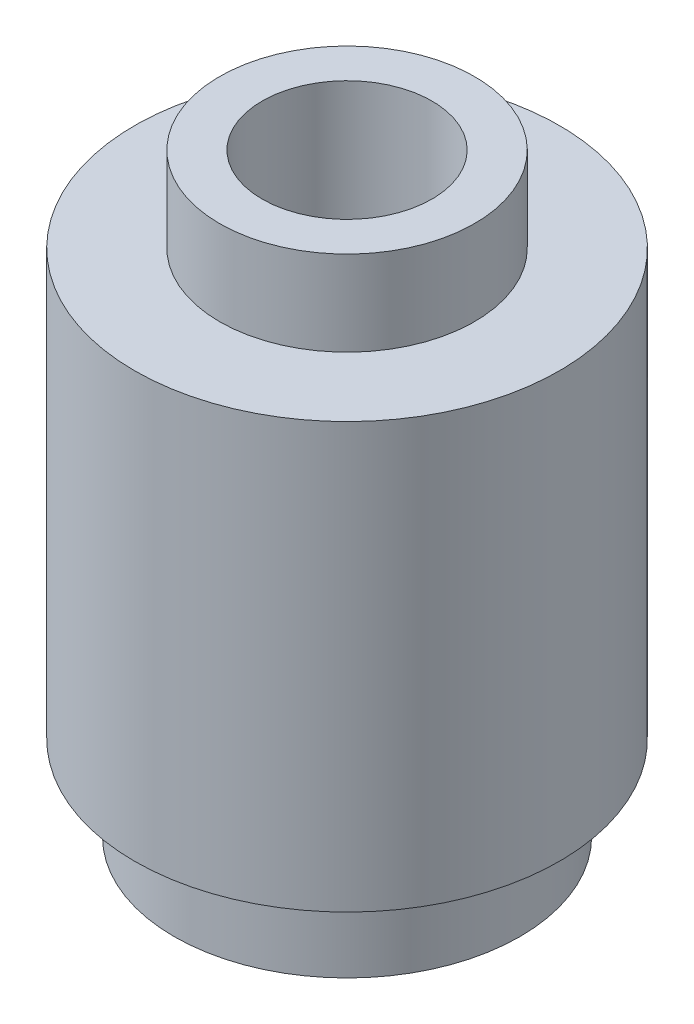
ISO-10303-21;
HEADER;
FILE_DESCRIPTION(('STEP AP214'),'2;1');
FILE_NAME('part.step','',(''),(''),'','','');
FILE_SCHEMA(('AUTOMOTIVE_DESIGN { 1 0 10303 214 1 1 1 1 }'));
ENDSEC;
DATA;
#1=APPLICATION_CONTEXT('core data for automotive mechanical design processes');
#2=APPLICATION_PROTOCOL_DEFINITION('international standard','automotive_design',2000,#1);
#3=PRODUCT_CONTEXT('',#1,'mechanical');
#4=PRODUCT('Part','Part','',(#3));
#5=PRODUCT_RELATED_PRODUCT_CATEGORY('part','',(#4));
#6=PRODUCT_DEFINITION_FORMATION('','',#4);
#7=PRODUCT_DEFINITION_CONTEXT('part definition',#1,'design');
#8=PRODUCT_DEFINITION('design','',#6,#7);
#9=PRODUCT_DEFINITION_SHAPE('','',#8);
#10=(LENGTH_UNIT() NAMED_UNIT(*) SI_UNIT(.MILLI.,.METRE.));
#11=(NAMED_UNIT(*) PLANE_ANGLE_UNIT() SI_UNIT($,.RADIAN.));
#12=(NAMED_UNIT(*) SI_UNIT($,.STERADIAN.) SOLID_ANGLE_UNIT());
#13=UNCERTAINTY_MEASURE_WITH_UNIT(LENGTH_MEASURE(1.E-05),#10,'distance_accuracy_value','');
#14=(GEOMETRIC_REPRESENTATION_CONTEXT(3) GLOBAL_UNCERTAINTY_ASSIGNED_CONTEXT((#13)) GLOBAL_UNIT_ASSIGNED_CONTEXT((#10,
#11,#12)) REPRESENTATION_CONTEXT('',''));
#15=CARTESIAN_POINT('',(0.,0.,0.));
#16=DIRECTION('',(0.,0.,1.));
#17=DIRECTION('',(1.,0.,0.));
#18=AXIS2_PLACEMENT_3D('',#15,#16,#17);
#19=CARTESIAN_POINT('',(0.,6.,0.));
#20=DIRECTION('',(0.,-1.,0.));
#21=DIRECTION('',(0.,0.,-1.));
#22=AXIS2_PLACEMENT_3D('',#19,#20,#21);
#23=CYLINDRICAL_SURFACE('',#22,1.5);
#24=CARTESIAN_POINT('',(0.,0.,0.));
#25=DIRECTION('',(0.,1.,0.));
#26=DIRECTION('',(0.,0.,1.));
#27=AXIS2_PLACEMENT_3D('',#24,#25,#26);
#28=CIRCLE('',#27,1.5);
#29=CARTESIAN_POINT('',(0.,0.,1.5));
#30=VERTEX_POINT('',#29);
#31=EDGE_CURVE('E37',#30,#30,#28,.T.);
#32=ORIENTED_EDGE('',*,*,#31,.F.);
#33=EDGE_LOOP('',(#32));
#34=FACE_BOUND('',#33,.T.);
#35=CARTESIAN_POINT('',(0.,5.,0.));
#36=DIRECTION('',(0.,1.,0.));
#37=DIRECTION('',(0.,0.,1.));
#38=AXIS2_PLACEMENT_3D('',#35,#36,#37);
#39=CIRCLE('',#38,1.5);
#40=CARTESIAN_POINT('',(0.,5.,1.5));
#41=VERTEX_POINT('',#40);
#42=EDGE_CURVE('E51',#41,#41,#39,.T.);
#43=ORIENTED_EDGE('',*,*,#42,.T.);
#44=EDGE_LOOP('',(#43));
#45=FACE_BOUND('',#44,.T.);
#46=ADVANCED_FACE('F33',(#34,#45),#23,.F.);
#47=CARTESIAN_POINT('',(0.,6.,0.));
#48=DIRECTION('',(0.,-1.,0.));
#49=DIRECTION('',(0.,0.,-1.));
#50=AXIS2_PLACEMENT_3D('',#47,#48,#49);
#51=CYLINDRICAL_SURFACE('',#50,2.5);
#52=CARTESIAN_POINT('',(0.,1.,0.));
#53=DIRECTION('',(0.,1.,0.));
#54=DIRECTION('',(0.,0.,1.));
#55=AXIS2_PLACEMENT_3D('',#52,#53,#54);
#56=CIRCLE('',#55,2.5);
#57=CARTESIAN_POINT('',(0.,1.,2.5));
#58=VERTEX_POINT('',#57);
#59=EDGE_CURVE('E52',#58,#58,#56,.T.);
#60=ORIENTED_EDGE('',*,*,#59,.T.);
#61=EDGE_LOOP('',(#60));
#62=FACE_BOUND('',#61,.T.);
#63=CARTESIAN_POINT('',(0.,6.,0.));
#64=DIRECTION('',(0.,1.,0.));
#65=DIRECTION('',(0.,0.,1.));
#66=AXIS2_PLACEMENT_3D('',#63,#64,#65);
#67=CIRCLE('',#66,2.5);
#68=CARTESIAN_POINT('',(0.,6.,2.5));
#69=VERTEX_POINT('',#68);
#70=EDGE_CURVE('E41',#69,#69,#67,.T.);
#71=ORIENTED_EDGE('',*,*,#70,.F.);
#72=EDGE_LOOP('',(#71));
#73=FACE_BOUND('',#72,.T.);
#74=ADVANCED_FACE('F35',(#62,#73),#51,.T.);
#75=CARTESIAN_POINT('',(0.,6.,0.));
#76=DIRECTION('',(0.,1.,0.));
#77=DIRECTION('',(0.,0.,1.));
#78=AXIS2_PLACEMENT_3D('',#75,#76,#77);
#79=PLANE('',#78);
#80=ORIENTED_EDGE('',*,*,#70,.T.);
#81=EDGE_LOOP('',(#80));
#82=FACE_BOUND('',#81,.T.);
#83=CARTESIAN_POINT('',(0.,6.,0.));
#84=DIRECTION('',(0.,1.,0.));
#85=DIRECTION('',(0.,0.,1.));
#86=AXIS2_PLACEMENT_3D('',#83,#84,#85);
#87=CIRCLE('',#86,1.5);
#88=CARTESIAN_POINT('',(0.,6.,1.5));
#89=VERTEX_POINT('',#88);
#90=EDGE_CURVE('E10',#89,#89,#87,.T.);
#91=ORIENTED_EDGE('',*,*,#90,.F.);
#92=EDGE_LOOP('',(#91));
#93=FACE_BOUND('',#92,.T.);
#94=ADVANCED_FACE('F86',(#82,#93),#79,.T.);
#95=CARTESIAN_POINT('',(0.,0.,0.));
#96=DIRECTION('',(0.,1.,0.));
#97=DIRECTION('',(0.,0.,1.));
#98=AXIS2_PLACEMENT_3D('',#95,#96,#97);
#99=PLANE('',#98);
#100=CARTESIAN_POINT('',(0.,0.,0.));
#101=DIRECTION('',(0.,1.,0.));
#102=DIRECTION('',(0.,0.,1.));
#103=AXIS2_PLACEMENT_3D('',#100,#101,#102);
#104=CIRCLE('',#103,2.03553390593274);
#105=CARTESIAN_POINT('',(0.,0.,2.03553390593274));
#106=VERTEX_POINT('',#105);
#107=EDGE_CURVE('E47',#106,#106,#104,.T.);
#108=ORIENTED_EDGE('',*,*,#107,.F.);
#109=EDGE_LOOP('',(#108));
#110=FACE_BOUND('',#109,.T.);
#111=ORIENTED_EDGE('',*,*,#31,.T.);
#112=EDGE_LOOP('',(#111));
#113=FACE_BOUND('',#112,.T.);
#114=ADVANCED_FACE('F91',(#110,#113),#99,.F.);
#115=CARTESIAN_POINT('',(0.,1.,0.));
#116=DIRECTION('',(0.,-1.,0.));
#117=DIRECTION('',(0.,0.,-1.));
#118=AXIS2_PLACEMENT_3D('',#115,#116,#117);
#119=CYLINDRICAL_SURFACE('',#118,2.03553390593274);
#120=CARTESIAN_POINT('',(0.,1.,0.));
#121=DIRECTION('',(0.,1.,0.));
#122=DIRECTION('',(0.,0.,1.));
#123=AXIS2_PLACEMENT_3D('',#120,#121,#122);
#124=CIRCLE('',#123,2.03553390593274);
#125=CARTESIAN_POINT('',(0.,1.,2.03553390593274));
#126=VERTEX_POINT('',#125);
#127=EDGE_CURVE('E50',#126,#126,#124,.T.);
#128=ORIENTED_EDGE('',*,*,#127,.F.);
#129=EDGE_LOOP('',(#128));
#130=FACE_BOUND('',#129,.T.);
#131=ORIENTED_EDGE('',*,*,#107,.T.);
#132=EDGE_LOOP('',(#131));
#133=FACE_BOUND('',#132,.T.);
#134=ADVANCED_FACE('F94',(#130,#133),#119,.T.);
#135=CARTESIAN_POINT('',(0.,1.,0.));
#136=DIRECTION('',(0.,1.,0.));
#137=DIRECTION('',(0.,0.,1.));
#138=AXIS2_PLACEMENT_3D('',#135,#136,#137);
#139=PLANE('',#138);
#140=ORIENTED_EDGE('',*,*,#127,.T.);
#141=EDGE_LOOP('',(#140));
#142=FACE_BOUND('',#141,.T.);
#143=ORIENTED_EDGE('',*,*,#59,.F.);
#144=EDGE_LOOP('',(#143));
#145=FACE_BOUND('',#144,.T.);
#146=ADVANCED_FACE('F101',(#142,#145),#139,.F.);
#147=CARTESIAN_POINT('',(0.,5.,0.));
#148=DIRECTION('',(0.,1.,0.));
#149=DIRECTION('',(0.,0.,1.));
#150=AXIS2_PLACEMENT_3D('',#147,#148,#149);
#151=CYLINDRICAL_SURFACE('',#150,1.5);
#152=ORIENTED_EDGE('',*,*,#90,.T.);
#153=EDGE_LOOP('',(#152));
#154=FACE_BOUND('',#153,.T.);
#155=CARTESIAN_POINT('',(0.,7.,0.));
#156=DIRECTION('',(0.,1.,0.));
#157=DIRECTION('',(0.,0.,1.));
#158=AXIS2_PLACEMENT_3D('',#155,#156,#157);
#159=CIRCLE('',#158,1.5);
#160=CARTESIAN_POINT('',(0.,7.,1.5));
#161=VERTEX_POINT('',#160);
#162=EDGE_CURVE('E62',#161,#161,#159,.T.);
#163=ORIENTED_EDGE('',*,*,#162,.F.);
#164=EDGE_LOOP('',(#163));
#165=FACE_BOUND('',#164,.T.);
#166=ADVANCED_FACE('F105',(#154,#165),#151,.T.);
#167=CARTESIAN_POINT('',(0.,5.,0.));
#168=DIRECTION('',(0.,1.,0.));
#169=DIRECTION('',(0.,0.,1.));
#170=AXIS2_PLACEMENT_3D('',#167,#168,#169);
#171=PLANE('',#170);
#172=CARTESIAN_POINT('',(0.,5.,0.));
#173=DIRECTION('',(0.,1.,0.));
#174=DIRECTION('',(0.,0.,1.));
#175=AXIS2_PLACEMENT_3D('',#172,#173,#174);
#176=CIRCLE('',#175,1.);
#177=CARTESIAN_POINT('',(0.,5.,1.));
#178=VERTEX_POINT('',#177);
#179=EDGE_CURVE('E59',#178,#178,#176,.T.);
#180=ORIENTED_EDGE('',*,*,#179,.T.);
#181=EDGE_LOOP('',(#180));
#182=FACE_BOUND('',#181,.T.);
#183=ORIENTED_EDGE('',*,*,#42,.F.);
#184=EDGE_LOOP('',(#183));
#185=FACE_BOUND('',#184,.T.);
#186=ADVANCED_FACE('F78',(#182,#185),#171,.F.);
#187=CARTESIAN_POINT('',(0.,5.,0.));
#188=DIRECTION('',(0.,1.,0.));
#189=DIRECTION('',(0.,0.,1.));
#190=AXIS2_PLACEMENT_3D('',#187,#188,#189);
#191=CYLINDRICAL_SURFACE('',#190,1.);
#192=ORIENTED_EDGE('',*,*,#179,.F.);
#193=EDGE_LOOP('',(#192));
#194=FACE_BOUND('',#193,.T.);
#195=CARTESIAN_POINT('',(0.,7.,0.));
#196=DIRECTION('',(0.,1.,0.));
#197=DIRECTION('',(0.,0.,1.));
#198=AXIS2_PLACEMENT_3D('',#195,#196,#197);
#199=CIRCLE('',#198,1.);
#200=CARTESIAN_POINT('',(0.,7.,1.));
#201=VERTEX_POINT('',#200);
#202=EDGE_CURVE('E65',#201,#201,#199,.T.);
#203=ORIENTED_EDGE('',*,*,#202,.T.);
#204=EDGE_LOOP('',(#203));
#205=FACE_BOUND('',#204,.T.);
#206=ADVANCED_FACE('F69',(#194,#205),#191,.F.);
#207=CARTESIAN_POINT('',(0.,7.,0.));
#208=DIRECTION('',(0.,1.,0.));
#209=DIRECTION('',(0.,0.,1.));
#210=AXIS2_PLACEMENT_3D('',#207,#208,#209);
#211=PLANE('',#210);
#212=ORIENTED_EDGE('',*,*,#162,.T.);
#213=EDGE_LOOP('',(#212));
#214=FACE_BOUND('',#213,.T.);
#215=ORIENTED_EDGE('',*,*,#202,.F.);
#216=EDGE_LOOP('',(#215));
#217=FACE_BOUND('',#216,.T.);
#218=ADVANCED_FACE('F71',(#214,#217),#211,.T.);
#219=CLOSED_SHELL('',(#46,#74,#94,#114,#134,#146,#166,#186,#206,#218));
#220=MANIFOLD_SOLID_BREP('B2',#219);
#221=ADVANCED_BREP_SHAPE_REPRESENTATION('',(#18,#220),#14);
#222=SHAPE_DEFINITION_REPRESENTATION(#9,#221);
ENDSEC;
END-ISO-10303-21;
